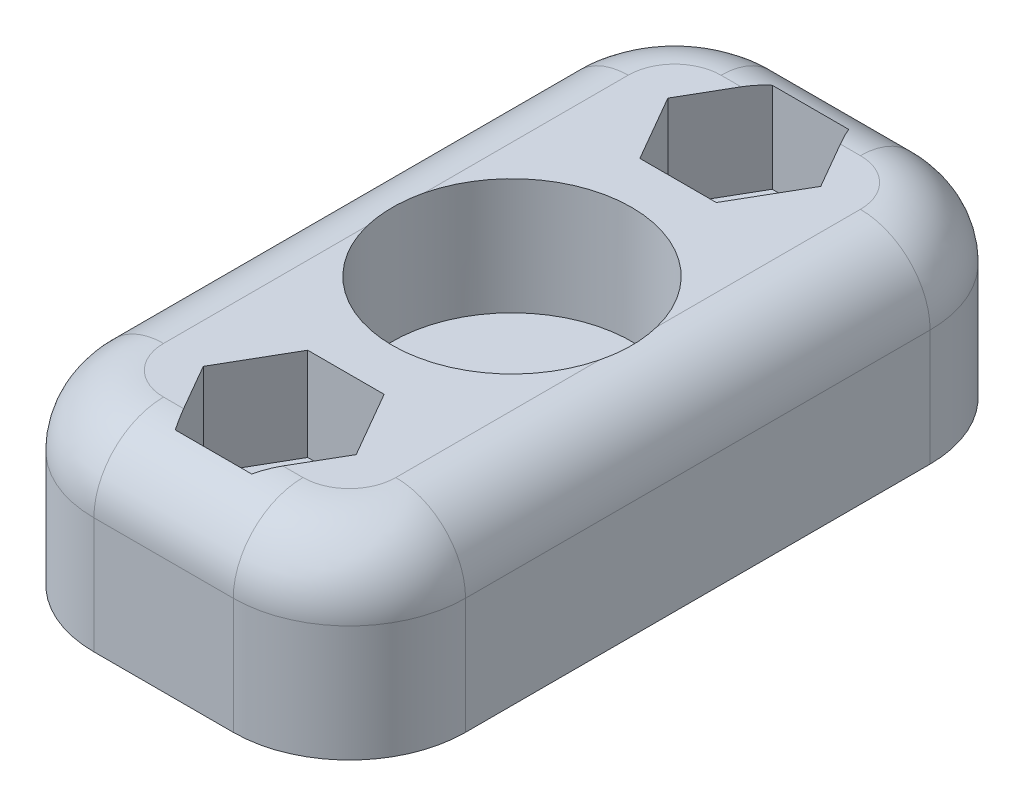
ISO-10303-21;
HEADER;
FILE_DESCRIPTION(('STEP AP214'),'2;1');
FILE_NAME('part.step','',(''),(''),'','','');
FILE_SCHEMA(('AUTOMOTIVE_DESIGN { 1 0 10303 214 1 1 1 1 }'));
ENDSEC;
DATA;
#1=APPLICATION_CONTEXT('core data for automotive mechanical design processes');
#2=APPLICATION_PROTOCOL_DEFINITION('international standard','automotive_design',2000,#1);
#3=PRODUCT_CONTEXT('',#1,'mechanical');
#4=PRODUCT('Part','Part','',(#3));
#5=PRODUCT_RELATED_PRODUCT_CATEGORY('part','',(#4));
#6=PRODUCT_DEFINITION_FORMATION('','',#4);
#7=PRODUCT_DEFINITION_CONTEXT('part definition',#1,'design');
#8=PRODUCT_DEFINITION('design','',#6,#7);
#9=PRODUCT_DEFINITION_SHAPE('','',#8);
#10=(LENGTH_UNIT() NAMED_UNIT(*) SI_UNIT(.MILLI.,.METRE.));
#11=(NAMED_UNIT(*) PLANE_ANGLE_UNIT() SI_UNIT($,.RADIAN.));
#12=(NAMED_UNIT(*) SI_UNIT($,.STERADIAN.) SOLID_ANGLE_UNIT());
#13=UNCERTAINTY_MEASURE_WITH_UNIT(LENGTH_MEASURE(1.E-05),#10,'distance_accuracy_value','');
#14=(GEOMETRIC_REPRESENTATION_CONTEXT(3) GLOBAL_UNCERTAINTY_ASSIGNED_CONTEXT((#13)) GLOBAL_UNIT_ASSIGNED_CONTEXT((#10,
#11,#12)) REPRESENTATION_CONTEXT('',''));
#15=CARTESIAN_POINT('',(0.,0.,0.));
#16=DIRECTION('',(0.,0.,1.));
#17=DIRECTION('',(1.,0.,0.));
#18=AXIS2_PLACEMENT_3D('',#15,#16,#17);
#19=CARTESIAN_POINT('',(0.,8.,0.));
#20=DIRECTION('',(0.,-1.,0.));
#21=DIRECTION('',(0.,0.,-1.));
#22=AXIS2_PLACEMENT_3D('',#19,#20,#21);
#23=PLANE('',#22);
#24=CARTESIAN_POINT('',(5.,8.,-25.));
#25=DIRECTION('',(0.,-1.,0.));
#26=DIRECTION('',(0.,0.,-1.));
#27=AXIS2_PLACEMENT_3D('',#24,#25,#26);
#28=CIRCLE('',#27,2.);
#29=CARTESIAN_POINT('',(5.,8.,-27.));
#30=VERTEX_POINT('',#29);
#31=CARTESIAN_POINT('',(3.,8.,-25.));
#32=VERTEX_POINT('',#31);
#33=EDGE_CURVE('E413',#30,#32,#28,.F.);
#34=ORIENTED_EDGE('',*,*,#33,.T.);
#35=DIRECTION('',(0.,0.,1.));
#36=VECTOR('',#35,1.);
#37=CARTESIAN_POINT('',(3.,8.,0.));
#38=LINE('',#37,#36);
#39=CARTESIAN_POINT('',(3.,8.,-16.2338962679253));
#40=VERTEX_POINT('',#39);
#41=EDGE_CURVE('E415',#32,#40,#38,.T.);
#42=ORIENTED_EDGE('',*,*,#41,.T.);
#43=CARTESIAN_POINT('',(8.,8.,-15.));
#44=DIRECTION('',(0.,1.,0.));
#45=DIRECTION('',(0.,0.,1.));
#46=AXIS2_PLACEMENT_3D('',#43,#44,#45);
#47=CIRCLE('',#46,5.15);
#48=CARTESIAN_POINT('',(13.,8.,-16.2338962679253));
#49=VERTEX_POINT('',#48);
#50=EDGE_CURVE('E338',#49,#40,#47,.T.);
#51=ORIENTED_EDGE('',*,*,#50,.F.);
#52=DIRECTION('',(0.,0.,-1.));
#53=VECTOR('',#52,1.);
#54=CARTESIAN_POINT('',(13.,8.,0.));
#55=LINE('',#54,#53);
#56=CARTESIAN_POINT('',(13.,8.,-25.));
#57=VERTEX_POINT('',#56);
#58=EDGE_CURVE('E405',#49,#57,#55,.T.);
#59=ORIENTED_EDGE('',*,*,#58,.T.);
#60=CARTESIAN_POINT('',(11.,8.,-25.));
#61=DIRECTION('',(0.,-1.,0.));
#62=DIRECTION('',(0.,0.,-1.));
#63=AXIS2_PLACEMENT_3D('',#60,#61,#62);
#64=CIRCLE('',#63,2.);
#65=CARTESIAN_POINT('',(11.,8.,-27.));
#66=VERTEX_POINT('',#65);
#67=EDGE_CURVE('E407',#57,#66,#64,.F.);
#68=ORIENTED_EDGE('',*,*,#67,.T.);
#69=DIRECTION('',(-1.,0.,0.));
#70=VECTOR('',#69,1.);
#71=CARTESIAN_POINT('',(0.,8.,-27.));
#72=LINE('',#71,#70);
#73=CARTESIAN_POINT('',(10.1361959960016,8.,-27.));
#74=VERTEX_POINT('',#73);
#75=EDGE_CURVE('E409',#66,#74,#72,.T.);
#76=ORIENTED_EDGE('',*,*,#75,.T.);
#77=DIRECTION('',(-0.499999999999998,0.,-0.86602540378444));
#78=VECTOR('',#77,1.);
#79=CARTESIAN_POINT('',(9.64544826719043,8.,-27.85));
#80=LINE('',#79,#78);
#81=CARTESIAN_POINT('',(11.2908965343809,8.,-25.));
#82=VERTEX_POINT('',#81);
#83=EDGE_CURVE('E258',#82,#74,#80,.T.);
#84=ORIENTED_EDGE('',*,*,#83,.F.);
#85=DIRECTION('',(0.499999999999998,0.,-0.866025403784439));
#86=VECTOR('',#85,1.);
#87=CARTESIAN_POINT('',(11.2908965343809,8.,-25.));
#88=LINE('',#87,#86);
#89=CARTESIAN_POINT('',(9.64544826719043,8.,-22.15));
#90=VERTEX_POINT('',#89);
#91=EDGE_CURVE('E261',#90,#82,#88,.T.);
#92=ORIENTED_EDGE('',*,*,#91,.F.);
#93=DIRECTION('',(1.,0.,0.));
#94=VECTOR('',#93,1.);
#95=CARTESIAN_POINT('',(9.64544826719043,8.,-22.15));
#96=LINE('',#95,#94);
#97=CARTESIAN_POINT('',(6.35455173280957,8.,-22.15));
#98=VERTEX_POINT('',#97);
#99=EDGE_CURVE('E275',#98,#90,#96,.T.);
#100=ORIENTED_EDGE('',*,*,#99,.F.);
#101=DIRECTION('',(0.499999999999998,0.,0.86602540378444));
#102=VECTOR('',#101,1.);
#103=CARTESIAN_POINT('',(6.35455173280957,8.,-22.15));
#104=LINE('',#103,#102);
#105=CARTESIAN_POINT('',(4.70910346561915,8.,-25.));
#106=VERTEX_POINT('',#105);
#107=EDGE_CURVE('E272',#106,#98,#104,.T.);
#108=ORIENTED_EDGE('',*,*,#107,.F.);
#109=DIRECTION('',(-0.499999999999998,0.,0.86602540378444));
#110=VECTOR('',#109,1.);
#111=CARTESIAN_POINT('',(4.70910346561915,8.,-25.));
#112=LINE('',#111,#110);
#113=CARTESIAN_POINT('',(5.86380400399839,8.,-27.));
#114=VERTEX_POINT('',#113);
#115=EDGE_CURVE('E240',#114,#106,#112,.T.);
#116=ORIENTED_EDGE('',*,*,#115,.F.);
#117=DIRECTION('',(-1.,0.,0.));
#118=VECTOR('',#117,1.);
#119=CARTESIAN_POINT('',(0.,8.,-27.));
#120=LINE('',#119,#118);
#121=EDGE_CURVE('E411',#114,#30,#120,.T.);
#122=ORIENTED_EDGE('',*,*,#121,.T.);
#123=EDGE_LOOP('',(#34,#42,#51,#59,#68,#76,#84,#92,#100,#108,#116,#122));
#124=FACE_BOUND('',#123,.T.);
#125=ADVANCED_FACE('F45',(#124),#23,.F.);
#126=CARTESIAN_POINT('',(3.,8.,-13.7661037320747));
#127=VERTEX_POINT('',#126);
#128=CARTESIAN_POINT('',(13.,8.,-13.7661037320747));
#129=VERTEX_POINT('',#128);
#130=EDGE_CURVE('E339',#127,#129,#47,.T.);
#131=ORIENTED_EDGE('',*,*,#130,.F.);
#132=DIRECTION('',(0.,0.,1.));
#133=VECTOR('',#132,1.);
#134=CARTESIAN_POINT('',(3.,8.,0.));
#135=LINE('',#134,#133);
#136=CARTESIAN_POINT('',(3.,8.,-5.));
#137=VERTEX_POINT('',#136);
#138=EDGE_CURVE('E403',#127,#137,#135,.T.);
#139=ORIENTED_EDGE('',*,*,#138,.T.);
#140=CARTESIAN_POINT('',(5.,8.,-5.));
#141=DIRECTION('',(0.,-1.,0.));
#142=DIRECTION('',(0.,0.,-1.));
#143=AXIS2_PLACEMENT_3D('',#140,#141,#142);
#144=CIRCLE('',#143,2.);
#145=CARTESIAN_POINT('',(5.,8.,-3.));
#146=VERTEX_POINT('',#145);
#147=EDGE_CURVE('E400',#137,#146,#144,.F.);
#148=ORIENTED_EDGE('',*,*,#147,.T.);
#149=DIRECTION('',(1.,0.,0.));
#150=VECTOR('',#149,1.);
#151=CARTESIAN_POINT('',(0.,8.,-3.));
#152=LINE('',#151,#150);
#153=CARTESIAN_POINT('',(5.86380400399839,8.,-3.));
#154=VERTEX_POINT('',#153);
#155=EDGE_CURVE('E398',#146,#154,#152,.T.);
#156=ORIENTED_EDGE('',*,*,#155,.T.);
#157=DIRECTION('',(0.499999999999998,0.,0.86602540378444));
#158=VECTOR('',#157,1.);
#159=CARTESIAN_POINT('',(6.35455173280957,8.,-2.15));
#160=LINE('',#159,#158);
#161=CARTESIAN_POINT('',(4.70910346561914,8.,-5.));
#162=VERTEX_POINT('',#161);
#163=EDGE_CURVE('E315',#162,#154,#160,.T.);
#164=ORIENTED_EDGE('',*,*,#163,.F.);
#165=DIRECTION('',(-0.499999999999998,0.,0.86602540378444));
#166=VECTOR('',#165,1.);
#167=CARTESIAN_POINT('',(4.70910346561915,8.,-5.));
#168=LINE('',#167,#166);
#169=CARTESIAN_POINT('',(6.35455173280957,8.,-7.85));
#170=VERTEX_POINT('',#169);
#171=EDGE_CURVE('E273',#170,#162,#168,.T.);
#172=ORIENTED_EDGE('',*,*,#171,.F.);
#173=DIRECTION('',(-1.,0.,0.));
#174=VECTOR('',#173,1.);
#175=CARTESIAN_POINT('',(6.35455173280957,8.,-7.85));
#176=LINE('',#175,#174);
#177=CARTESIAN_POINT('',(9.64544826719043,8.,-7.85));
#178=VERTEX_POINT('',#177);
#179=EDGE_CURVE('E306',#178,#170,#176,.T.);
#180=ORIENTED_EDGE('',*,*,#179,.F.);
#181=DIRECTION('',(-0.499999999999998,0.,-0.86602540378444));
#182=VECTOR('',#181,1.);
#183=CARTESIAN_POINT('',(9.64544826719043,8.,-7.85));
#184=LINE('',#183,#182);
#185=CARTESIAN_POINT('',(11.2908965343809,8.,-5.));
#186=VERTEX_POINT('',#185);
#187=EDGE_CURVE('E309',#186,#178,#184,.T.);
#188=ORIENTED_EDGE('',*,*,#187,.F.);
#189=DIRECTION('',(0.499999999999998,0.,-0.86602540378444));
#190=VECTOR('',#189,1.);
#191=CARTESIAN_POINT('',(11.2908965343809,8.,-5.));
#192=LINE('',#191,#190);
#193=CARTESIAN_POINT('',(10.1361959960016,8.,-3.));
#194=VERTEX_POINT('',#193);
#195=EDGE_CURVE('E313',#194,#186,#192,.T.);
#196=ORIENTED_EDGE('',*,*,#195,.F.);
#197=DIRECTION('',(1.,0.,0.));
#198=VECTOR('',#197,1.);
#199=CARTESIAN_POINT('',(0.,8.,-3.));
#200=LINE('',#199,#198);
#201=CARTESIAN_POINT('',(11.,8.,-3.));
#202=VERTEX_POINT('',#201);
#203=EDGE_CURVE('E388',#194,#202,#200,.T.);
#204=ORIENTED_EDGE('',*,*,#203,.T.);
#205=CARTESIAN_POINT('',(11.,8.,-5.));
#206=DIRECTION('',(0.,-1.,0.));
#207=DIRECTION('',(0.,0.,-1.));
#208=AXIS2_PLACEMENT_3D('',#205,#206,#207);
#209=CIRCLE('',#208,2.);
#210=CARTESIAN_POINT('',(13.,8.,-5.));
#211=VERTEX_POINT('',#210);
#212=EDGE_CURVE('E394',#202,#211,#209,.F.);
#213=ORIENTED_EDGE('',*,*,#212,.T.);
#214=DIRECTION('',(0.,0.,-1.));
#215=VECTOR('',#214,1.);
#216=CARTESIAN_POINT('',(13.,8.,0.));
#217=LINE('',#216,#215);
#218=EDGE_CURVE('E396',#211,#129,#217,.T.);
#219=ORIENTED_EDGE('',*,*,#218,.T.);
#220=EDGE_LOOP('',(#131,#139,#148,#156,#164,#172,#180,#188,#196,#204,#213,#219));
#221=FACE_BOUND('',#220,.T.);
#222=ADVANCED_FACE('F456',(#221),#23,.F.);
#223=CARTESIAN_POINT('',(0.,0.,0.));
#224=DIRECTION('',(0.,-1.,0.));
#225=DIRECTION('',(0.,0.,-1.));
#226=AXIS2_PLACEMENT_3D('',#223,#224,#225);
#227=PLANE('',#226);
#228=CARTESIAN_POINT('',(8.,0.,-25.));
#229=DIRECTION('',(0.,1.,0.));
#230=DIRECTION('',(0.,0.,1.));
#231=AXIS2_PLACEMENT_3D('',#228,#229,#230);
#232=CIRCLE('',#231,1.75);
#233=CARTESIAN_POINT('',(8.,0.,-23.25));
#234=VERTEX_POINT('',#233);
#235=EDGE_CURVE('E345',#234,#234,#232,.T.);
#236=ORIENTED_EDGE('',*,*,#235,.T.);
#237=EDGE_LOOP('',(#236));
#238=FACE_BOUND('',#237,.T.);
#239=DIRECTION('',(1.,0.,0.));
#240=VECTOR('',#239,1.);
#241=CARTESIAN_POINT('',(0.,0.,0.));
#242=LINE('',#241,#240);
#243=CARTESIAN_POINT('',(5.,0.,0.));
#244=VERTEX_POINT('',#243);
#245=CARTESIAN_POINT('',(11.,0.,0.));
#246=VERTEX_POINT('',#245);
#247=EDGE_CURVE('E351',#244,#246,#242,.T.);
#248=ORIENTED_EDGE('',*,*,#247,.F.);
#249=CARTESIAN_POINT('',(5.,0.,-5.));
#250=DIRECTION('',(0.,-1.,0.));
#251=DIRECTION('',(0.,0.,-1.));
#252=AXIS2_PLACEMENT_3D('',#249,#250,#251);
#253=CIRCLE('',#252,5.);
#254=CARTESIAN_POINT('',(0.,0.,-5.));
#255=VERTEX_POINT('',#254);
#256=EDGE_CURVE('E371',#244,#255,#253,.T.);
#257=ORIENTED_EDGE('',*,*,#256,.T.);
#258=DIRECTION('',(0.,0.,1.));
#259=VECTOR('',#258,1.);
#260=CARTESIAN_POINT('',(0.,0.,0.));
#261=LINE('',#260,#259);
#262=CARTESIAN_POINT('',(0.,0.,-25.));
#263=VERTEX_POINT('',#262);
#264=EDGE_CURVE('E348',#263,#255,#261,.T.);
#265=ORIENTED_EDGE('',*,*,#264,.F.);
#266=CARTESIAN_POINT('',(5.,0.,-25.));
#267=DIRECTION('',(0.,-1.,0.));
#268=DIRECTION('',(0.,0.,-1.));
#269=AXIS2_PLACEMENT_3D('',#266,#267,#268);
#270=CIRCLE('',#269,5.);
#271=CARTESIAN_POINT('',(5.,0.,-30.));
#272=VERTEX_POINT('',#271);
#273=EDGE_CURVE('E367',#263,#272,#270,.T.);
#274=ORIENTED_EDGE('',*,*,#273,.T.);
#275=DIRECTION('',(-1.,0.,0.));
#276=VECTOR('',#275,1.);
#277=CARTESIAN_POINT('',(0.,0.,-30.));
#278=LINE('',#277,#276);
#279=CARTESIAN_POINT('',(11.,0.,-30.));
#280=VERTEX_POINT('',#279);
#281=EDGE_CURVE('E357',#280,#272,#278,.T.);
#282=ORIENTED_EDGE('',*,*,#281,.F.);
#283=CARTESIAN_POINT('',(11.,0.,-25.));
#284=DIRECTION('',(0.,-1.,0.));
#285=DIRECTION('',(0.,0.,-1.));
#286=AXIS2_PLACEMENT_3D('',#283,#284,#285);
#287=CIRCLE('',#286,5.);
#288=CARTESIAN_POINT('',(16.,0.,-25.));
#289=VERTEX_POINT('',#288);
#290=EDGE_CURVE('E365',#280,#289,#287,.T.);
#291=ORIENTED_EDGE('',*,*,#290,.T.);
#292=DIRECTION('',(0.,0.,-1.));
#293=VECTOR('',#292,1.);
#294=CARTESIAN_POINT('',(16.,0.,0.));
#295=LINE('',#294,#293);
#296=CARTESIAN_POINT('',(16.,0.,-5.));
#297=VERTEX_POINT('',#296);
#298=EDGE_CURVE('E354',#297,#289,#295,.T.);
#299=ORIENTED_EDGE('',*,*,#298,.F.);
#300=CARTESIAN_POINT('',(11.,0.,-5.));
#301=DIRECTION('',(0.,-1.,0.));
#302=DIRECTION('',(0.,0.,-1.));
#303=AXIS2_PLACEMENT_3D('',#300,#301,#302);
#304=CIRCLE('',#303,5.);
#305=EDGE_CURVE('E369',#297,#246,#304,.T.);
#306=ORIENTED_EDGE('',*,*,#305,.T.);
#307=EDGE_LOOP('',(#248,#257,#265,#274,#282,#291,#299,#306));
#308=FACE_BOUND('',#307,.T.);
#309=CARTESIAN_POINT('',(8.,0.,-5.));
#310=DIRECTION('',(0.,1.,0.));
#311=DIRECTION('',(0.,0.,-1.));
#312=AXIS2_PLACEMENT_3D('',#309,#310,#311);
#313=CIRCLE('',#312,1.75);
#314=CARTESIAN_POINT('',(8.,0.,-6.75));
#315=VERTEX_POINT('',#314);
#316=EDGE_CURVE('E337',#315,#315,#313,.T.);
#317=ORIENTED_EDGE('',*,*,#316,.T.);
#318=EDGE_LOOP('',(#317));
#319=FACE_BOUND('',#318,.T.);
#320=ADVANCED_FACE('F459',(#238,#308,#319),#227,.T.);
#321=CARTESIAN_POINT('',(0.,8.,0.));
#322=DIRECTION('',(1.,0.,0.));
#323=DIRECTION('',(0.,0.,-1.));
#324=AXIS2_PLACEMENT_3D('',#321,#322,#323);
#325=PLANE('',#324);
#326=DIRECTION('',(0.,-1.,0.));
#327=VECTOR('',#326,1.);
#328=CARTESIAN_POINT('',(0.,8.,-5.));
#329=LINE('',#328,#327);
#330=CARTESIAN_POINT('',(0.,5.,-5.));
#331=VERTEX_POINT('',#330);
#332=EDGE_CURVE('E375',#255,#331,#329,.F.);
#333=ORIENTED_EDGE('',*,*,#332,.T.);
#334=DIRECTION('',(0.,0.,1.));
#335=VECTOR('',#334,1.);
#336=CARTESIAN_POINT('',(0.,5.,0.));
#337=LINE('',#336,#335);
#338=CARTESIAN_POINT('',(0.,5.,-25.));
#339=VERTEX_POINT('',#338);
#340=EDGE_CURVE('E545',#331,#339,#337,.F.);
#341=ORIENTED_EDGE('',*,*,#340,.T.);
#342=DIRECTION('',(0.,-1.,0.));
#343=VECTOR('',#342,1.);
#344=CARTESIAN_POINT('',(0.,8.,-25.));
#345=LINE('',#344,#343);
#346=EDGE_CURVE('E373',#339,#263,#345,.T.);
#347=ORIENTED_EDGE('',*,*,#346,.T.);
#348=ORIENTED_EDGE('',*,*,#264,.T.);
#349=EDGE_LOOP('',(#333,#341,#347,#348));
#350=FACE_BOUND('',#349,.T.);
#351=ADVANCED_FACE('F463',(#350),#325,.F.);
#352=CARTESIAN_POINT('',(0.,8.,0.));
#353=DIRECTION('',(0.,0.,-1.));
#354=DIRECTION('',(-1.,0.,0.));
#355=AXIS2_PLACEMENT_3D('',#352,#353,#354);
#356=PLANE('',#355);
#357=DIRECTION('',(0.,-1.,0.));
#358=VECTOR('',#357,1.);
#359=CARTESIAN_POINT('',(11.,8.,0.));
#360=LINE('',#359,#358);
#361=CARTESIAN_POINT('',(11.,5.,0.));
#362=VERTEX_POINT('',#361);
#363=EDGE_CURVE('E360',#246,#362,#360,.F.);
#364=ORIENTED_EDGE('',*,*,#363,.T.);
#365=DIRECTION('',(1.,0.,0.));
#366=VECTOR('',#365,1.);
#367=CARTESIAN_POINT('',(0.,5.,0.));
#368=LINE('',#367,#366);
#369=CARTESIAN_POINT('',(5.,5.,0.));
#370=VERTEX_POINT('',#369);
#371=EDGE_CURVE('E11',#362,#370,#368,.F.);
#372=ORIENTED_EDGE('',*,*,#371,.T.);
#373=DIRECTION('',(0.,-1.,0.));
#374=VECTOR('',#373,1.);
#375=CARTESIAN_POINT('',(5.,8.,0.));
#376=LINE('',#375,#374);
#377=EDGE_CURVE('E363',#370,#244,#376,.T.);
#378=ORIENTED_EDGE('',*,*,#377,.T.);
#379=ORIENTED_EDGE('',*,*,#247,.T.);
#380=EDGE_LOOP('',(#364,#372,#378,#379));
#381=FACE_BOUND('',#380,.T.);
#382=ADVANCED_FACE('F471',(#381),#356,.F.);
#383=CARTESIAN_POINT('',(16.,8.,0.));
#384=DIRECTION('',(-1.,0.,0.));
#385=DIRECTION('',(0.,0.,1.));
#386=AXIS2_PLACEMENT_3D('',#383,#384,#385);
#387=PLANE('',#386);
#388=DIRECTION('',(0.,-1.,0.));
#389=VECTOR('',#388,1.);
#390=CARTESIAN_POINT('',(16.,8.,-25.));
#391=LINE('',#390,#389);
#392=CARTESIAN_POINT('',(16.,5.,-25.));
#393=VERTEX_POINT('',#392);
#394=EDGE_CURVE('E378',#289,#393,#391,.F.);
#395=ORIENTED_EDGE('',*,*,#394,.T.);
#396=DIRECTION('',(0.,0.,-1.));
#397=VECTOR('',#396,1.);
#398=CARTESIAN_POINT('',(16.,5.,0.));
#399=LINE('',#398,#397);
#400=CARTESIAN_POINT('',(16.,5.,-5.));
#401=VERTEX_POINT('',#400);
#402=EDGE_CURVE('E559',#393,#401,#399,.F.);
#403=ORIENTED_EDGE('',*,*,#402,.T.);
#404=DIRECTION('',(0.,-1.,0.));
#405=VECTOR('',#404,1.);
#406=CARTESIAN_POINT('',(16.,8.,-5.));
#407=LINE('',#406,#405);
#408=EDGE_CURVE('E381',#401,#297,#407,.T.);
#409=ORIENTED_EDGE('',*,*,#408,.T.);
#410=ORIENTED_EDGE('',*,*,#298,.T.);
#411=EDGE_LOOP('',(#395,#403,#409,#410));
#412=FACE_BOUND('',#411,.T.);
#413=ADVANCED_FACE('F467',(#412),#387,.F.);
#414=CARTESIAN_POINT('',(0.,8.,-30.));
#415=DIRECTION('',(0.,0.,1.));
#416=DIRECTION('',(1.,0.,0.));
#417=AXIS2_PLACEMENT_3D('',#414,#415,#416);
#418=PLANE('',#417);
#419=DIRECTION('',(0.,-1.,0.));
#420=VECTOR('',#419,1.);
#421=CARTESIAN_POINT('',(5.,8.,-30.));
#422=LINE('',#421,#420);
#423=CARTESIAN_POINT('',(5.,5.,-30.));
#424=VERTEX_POINT('',#423);
#425=EDGE_CURVE('E385',#272,#424,#422,.F.);
#426=ORIENTED_EDGE('',*,*,#425,.T.);
#427=DIRECTION('',(-1.,0.,0.));
#428=VECTOR('',#427,1.);
#429=CARTESIAN_POINT('',(0.,5.,-30.));
#430=LINE('',#429,#428);
#431=CARTESIAN_POINT('',(11.,5.,-30.));
#432=VERTEX_POINT('',#431);
#433=EDGE_CURVE('E555',#424,#432,#430,.F.);
#434=ORIENTED_EDGE('',*,*,#433,.T.);
#435=DIRECTION('',(0.,-1.,0.));
#436=VECTOR('',#435,1.);
#437=CARTESIAN_POINT('',(11.,8.,-30.));
#438=LINE('',#437,#436);
#439=EDGE_CURVE('E383',#432,#280,#438,.T.);
#440=ORIENTED_EDGE('',*,*,#439,.T.);
#441=ORIENTED_EDGE('',*,*,#281,.T.);
#442=EDGE_LOOP('',(#426,#434,#440,#441));
#443=FACE_BOUND('',#442,.T.);
#444=ADVANCED_FACE('F454',(#443),#418,.F.);
#445=CARTESIAN_POINT('',(8.,8.,-25.));
#446=DIRECTION('',(0.,-1.,0.));
#447=DIRECTION('',(0.,0.,-1.));
#448=AXIS2_PLACEMENT_3D('',#445,#446,#447);
#449=CYLINDRICAL_SURFACE('',#448,1.75);
#450=CARTESIAN_POINT('',(8.,4.,-25.));
#451=DIRECTION('',(0.,-1.,0.));
#452=DIRECTION('',(0.,0.,-1.));
#453=AXIS2_PLACEMENT_3D('',#450,#451,#452);
#454=CIRCLE('',#453,1.75);
#455=CARTESIAN_POINT('',(8.,4.,-26.75));
#456=VERTEX_POINT('',#455);
#457=EDGE_CURVE('E342',#456,#456,#454,.T.);
#458=ORIENTED_EDGE('',*,*,#457,.F.);
#459=EDGE_LOOP('',(#458));
#460=FACE_BOUND('',#459,.T.);
#461=ORIENTED_EDGE('',*,*,#235,.F.);
#462=EDGE_LOOP('',(#461));
#463=FACE_BOUND('',#462,.T.);
#464=ADVANCED_FACE('F450',(#460,#463),#449,.F.);
#465=CARTESIAN_POINT('',(8.,8.,-5.));
#466=DIRECTION('',(0.,-1.,0.));
#467=DIRECTION('',(0.,0.,-1.));
#468=AXIS2_PLACEMENT_3D('',#465,#466,#467);
#469=CYLINDRICAL_SURFACE('',#468,1.75);
#470=CARTESIAN_POINT('',(8.,4.,-5.));
#471=DIRECTION('',(0.,-1.,0.));
#472=DIRECTION('',(0.,0.,-1.));
#473=AXIS2_PLACEMENT_3D('',#470,#471,#472);
#474=CIRCLE('',#473,1.75);
#475=CARTESIAN_POINT('',(8.,4.,-6.75));
#476=VERTEX_POINT('',#475);
#477=EDGE_CURVE('E282',#476,#476,#474,.T.);
#478=ORIENTED_EDGE('',*,*,#477,.F.);
#479=EDGE_LOOP('',(#478));
#480=FACE_BOUND('',#479,.T.);
#481=ORIENTED_EDGE('',*,*,#316,.F.);
#482=EDGE_LOOP('',(#481));
#483=FACE_BOUND('',#482,.T.);
#484=ADVANCED_FACE('F444',(#480,#483),#469,.F.);
#485=CARTESIAN_POINT('',(8.,3.,-15.));
#486=DIRECTION('',(0.,1.,0.));
#487=DIRECTION('',(0.,0.,1.));
#488=AXIS2_PLACEMENT_3D('',#485,#486,#487);
#489=CYLINDRICAL_SURFACE('',#488,5.15);
#490=CARTESIAN_POINT('',(8.,3.,-15.));
#491=DIRECTION('',(0.,1.,0.));
#492=DIRECTION('',(0.,0.,1.));
#493=AXIS2_PLACEMENT_3D('',#490,#491,#492);
#494=CIRCLE('',#493,5.15);
#495=CARTESIAN_POINT('',(8.,3.,-9.85));
#496=VERTEX_POINT('',#495);
#497=EDGE_CURVE('E334',#496,#496,#494,.T.);
#498=ORIENTED_EDGE('',*,*,#497,.F.);
#499=EDGE_LOOP('',(#498));
#500=FACE_BOUND('',#499,.T.);
#501=ORIENTED_EDGE('',*,*,#50,.T.);
#502=CARTESIAN_POINT('',(3.,8.,-16.2338962679253));
#503=CARTESIAN_POINT('',(2.9693348427124,7.99995433878383,-16.1096726365028));
#504=CARTESIAN_POINT('',(2.94331745158033,7.99952800872603,-15.9843054356251));
#505=CARTESIAN_POINT('',(2.90067770771265,7.99844352484611,-15.7319595983456));
#506=CARTESIAN_POINT('',(2.88405713441141,7.99778532715451,-15.604980661388));
#507=CARTESIAN_POINT('',(2.86053019663547,7.99677596296455,-15.3523676885187));
#508=CARTESIAN_POINT('',(2.85345869644921,7.99641961793105,-15.2267490812954));
#509=CARTESIAN_POINT('',(2.84852469710433,7.99617465392725,-14.9753745735996));
#510=CARTESIAN_POINT('',(2.85065982147749,7.99628591425571,-14.8496187169329));
#511=CARTESIAN_POINT('',(2.86600988443529,7.99702161326098,-14.5635794261092));
#512=CARTESIAN_POINT('',(2.88214631032478,7.99778040473618,-14.4034388700295));
#513=CARTESIAN_POINT('',(2.91764846536141,7.9988915020192,-14.1640448025117));
#514=CARTESIAN_POINT('',(2.93147730408653,7.99925937223891,-14.0839282642454));
#515=CARTESIAN_POINT('',(2.96291287169983,7.99981110271986,-13.9244266670112));
#516=CARTESIAN_POINT('',(2.98052017049936,7.99999493519867,-13.8450417202764));
#517=CARTESIAN_POINT('',(3.,8.,-13.7661037320747));
#518=B_SPLINE_CURVE_WITH_KNOTS('',3,(#502,#503,#504,#505,#506,#507,#508,#509,#510,#511,#512,
#513,#514,#515,#516,#517),.UNSPECIFIED.,.F.,.F.,(4,2,2,2,2,2,2,4),(0.,0.383763617130559,
0.76759988158234,1.14470946569461,1.52172171388608,2.00378387199943,2.24761315566571,
2.49147924238542),.UNSPECIFIED.);
#519=EDGE_CURVE('E428',#40,#127,#518,.T.);
#520=ORIENTED_EDGE('',*,*,#519,.T.);
#521=ORIENTED_EDGE('',*,*,#130,.T.);
#522=CARTESIAN_POINT('',(13.,8.,-13.7661037320747));
#523=CARTESIAN_POINT('',(13.0306651572876,7.99995433878383,-13.8903273634972));
#524=CARTESIAN_POINT('',(13.0566825484197,7.99952800872603,-14.0156945643749));
#525=CARTESIAN_POINT('',(13.0993222922874,7.99844352484611,-14.2680404016545));
#526=CARTESIAN_POINT('',(13.1159428655886,7.99778532715451,-14.395019338612));
#527=CARTESIAN_POINT('',(13.1394698033645,7.99677596296455,-14.6476323114813));
#528=CARTESIAN_POINT('',(13.1465413035508,7.99641961793105,-14.7732509187047));
#529=CARTESIAN_POINT('',(13.1514753028957,7.99617465392725,-15.0246254264004));
#530=CARTESIAN_POINT('',(13.1493401785225,7.99628591425571,-15.1503812830671));
#531=CARTESIAN_POINT('',(13.1339901155647,7.99702161326098,-15.4364205738908));
#532=CARTESIAN_POINT('',(13.1178536896752,7.99778040473618,-15.5965611299705));
#533=CARTESIAN_POINT('',(13.0823515346386,7.9988915020192,-15.8359551974883));
#534=CARTESIAN_POINT('',(13.0685226959135,7.99925937223891,-15.9160717357546));
#535=CARTESIAN_POINT('',(13.0370871283002,7.99981110271986,-16.0755733329888));
#536=CARTESIAN_POINT('',(13.0194798295006,7.99999493519867,-16.1549582797236));
#537=CARTESIAN_POINT('',(13.,8.,-16.2338962679253));
#538=B_SPLINE_CURVE_WITH_KNOTS('',3,(#522,#523,#524,#525,#526,#527,#528,#529,#530,#531,#532,
#533,#534,#535,#536,#537),.UNSPECIFIED.,.F.,.F.,(4,2,2,2,2,2,2,4),(0.,0.383763617130561,
0.76759988158234,1.14470946569461,1.52172171388608,2.00378387199941,2.24761315566568,
2.49147924238538),.UNSPECIFIED.);
#539=EDGE_CURVE('E420',#129,#49,#538,.T.);
#540=ORIENTED_EDGE('',*,*,#539,.T.);
#541=EDGE_LOOP('',(#501,#520,#521,#540));
#542=FACE_BOUND('',#541,.T.);
#543=ADVANCED_FACE('F438',(#500,#542),#489,.F.);
#544=CARTESIAN_POINT('',(8.,3.,-15.));
#545=DIRECTION('',(0.,1.,0.));
#546=DIRECTION('',(0.,0.,1.));
#547=AXIS2_PLACEMENT_3D('',#544,#545,#546);
#548=PLANE('',#547);
#549=ORIENTED_EDGE('',*,*,#497,.T.);
#550=EDGE_LOOP('',(#549));
#551=FACE_BOUND('',#550,.T.);
#552=ADVANCED_FACE('F443',(#551),#548,.T.);
#553=CARTESIAN_POINT('',(5.,8.,-5.));
#554=DIRECTION('',(0.,-1.,0.));
#555=DIRECTION('',(0.,0.,-1.));
#556=AXIS2_PLACEMENT_3D('',#553,#554,#555);
#557=CYLINDRICAL_SURFACE('',#556,5.);
#558=ORIENTED_EDGE('',*,*,#377,.F.);
#559=CARTESIAN_POINT('',(5.,5.,-5.));
#560=DIRECTION('',(0.,-1.,0.));
#561=DIRECTION('',(0.,0.,-1.));
#562=AXIS2_PLACEMENT_3D('',#559,#560,#561);
#563=CIRCLE('',#562,5.);
#564=EDGE_CURVE('E417',#370,#331,#563,.T.);
#565=ORIENTED_EDGE('',*,*,#564,.T.);
#566=ORIENTED_EDGE('',*,*,#332,.F.);
#567=ORIENTED_EDGE('',*,*,#256,.F.);
#568=EDGE_LOOP('',(#558,#565,#566,#567));
#569=FACE_BOUND('',#568,.T.);
#570=ADVANCED_FACE('F479',(#569),#557,.T.);
#571=CARTESIAN_POINT('',(11.,8.,-5.));
#572=DIRECTION('',(0.,-1.,0.));
#573=DIRECTION('',(0.,0.,-1.));
#574=AXIS2_PLACEMENT_3D('',#571,#572,#573);
#575=CYLINDRICAL_SURFACE('',#574,5.);
#576=ORIENTED_EDGE('',*,*,#408,.F.);
#577=CARTESIAN_POINT('',(11.,5.,-5.));
#578=DIRECTION('',(0.,-1.,0.));
#579=DIRECTION('',(0.,0.,-1.));
#580=AXIS2_PLACEMENT_3D('',#577,#578,#579);
#581=CIRCLE('',#580,5.);
#582=EDGE_CURVE('E561',#401,#362,#581,.T.);
#583=ORIENTED_EDGE('',*,*,#582,.T.);
#584=ORIENTED_EDGE('',*,*,#363,.F.);
#585=ORIENTED_EDGE('',*,*,#305,.F.);
#586=EDGE_LOOP('',(#576,#583,#584,#585));
#587=FACE_BOUND('',#586,.T.);
#588=ADVANCED_FACE('F482',(#587),#575,.T.);
#589=CARTESIAN_POINT('',(5.,8.,-25.));
#590=DIRECTION('',(0.,-1.,0.));
#591=DIRECTION('',(0.,0.,-1.));
#592=AXIS2_PLACEMENT_3D('',#589,#590,#591);
#593=CYLINDRICAL_SURFACE('',#592,5.);
#594=ORIENTED_EDGE('',*,*,#346,.F.);
#595=CARTESIAN_POINT('',(5.,5.,-25.));
#596=DIRECTION('',(0.,-1.,0.));
#597=DIRECTION('',(0.,0.,-1.));
#598=AXIS2_PLACEMENT_3D('',#595,#596,#597);
#599=CIRCLE('',#598,5.);
#600=EDGE_CURVE('E535',#339,#424,#599,.T.);
#601=ORIENTED_EDGE('',*,*,#600,.T.);
#602=ORIENTED_EDGE('',*,*,#425,.F.);
#603=ORIENTED_EDGE('',*,*,#273,.F.);
#604=EDGE_LOOP('',(#594,#601,#602,#603));
#605=FACE_BOUND('',#604,.T.);
#606=ADVANCED_FACE('F486',(#605),#593,.T.);
#607=CARTESIAN_POINT('',(11.,8.,-25.));
#608=DIRECTION('',(0.,-1.,0.));
#609=DIRECTION('',(0.,0.,-1.));
#610=AXIS2_PLACEMENT_3D('',#607,#608,#609);
#611=CYLINDRICAL_SURFACE('',#610,5.);
#612=ORIENTED_EDGE('',*,*,#439,.F.);
#613=CARTESIAN_POINT('',(11.,5.,-25.));
#614=DIRECTION('',(0.,-1.,0.));
#615=DIRECTION('',(0.,0.,-1.));
#616=AXIS2_PLACEMENT_3D('',#613,#614,#615);
#617=CIRCLE('',#616,5.);
#618=EDGE_CURVE('E557',#432,#393,#617,.T.);
#619=ORIENTED_EDGE('',*,*,#618,.T.);
#620=ORIENTED_EDGE('',*,*,#394,.F.);
#621=ORIENTED_EDGE('',*,*,#290,.F.);
#622=EDGE_LOOP('',(#612,#619,#620,#621));
#623=FACE_BOUND('',#622,.T.);
#624=ADVANCED_FACE('F490',(#623),#611,.T.);
#625=CARTESIAN_POINT('',(4.70910346561915,4.,-5.));
#626=DIRECTION('',(-0.86602540378444,0.,-0.499999999999998));
#627=DIRECTION('',(-0.499999999999998,0.,0.86602540378444));
#628=AXIS2_PLACEMENT_3D('',#625,#626,#627);
#629=PLANE('',#628);
#630=ORIENTED_EDGE('',*,*,#171,.T.);
#631=DIRECTION('',(0.,1.,0.));
#632=VECTOR('',#631,1.);
#633=CARTESIAN_POINT('',(4.70910346561915,4.,-5.));
#634=LINE('',#633,#632);
#635=CARTESIAN_POINT('',(4.70910346561915,4.,-5.));
#636=VERTEX_POINT('',#635);
#637=EDGE_CURVE('E291',#636,#162,#634,.T.);
#638=ORIENTED_EDGE('',*,*,#637,.F.);
#639=DIRECTION('',(-0.499999999999998,0.,0.86602540378444));
#640=VECTOR('',#639,1.);
#641=CARTESIAN_POINT('',(4.70910346561915,4.,-5.));
#642=LINE('',#641,#640);
#643=CARTESIAN_POINT('',(6.35455173280957,4.,-7.85));
#644=VERTEX_POINT('',#643);
#645=EDGE_CURVE('E310',#644,#636,#642,.T.);
#646=ORIENTED_EDGE('',*,*,#645,.F.);
#647=DIRECTION('',(0.,1.,0.));
#648=VECTOR('',#647,1.);
#649=CARTESIAN_POINT('',(6.35455173280957,4.,-7.85));
#650=LINE('',#649,#648);
#651=EDGE_CURVE('E304',#644,#170,#650,.T.);
#652=ORIENTED_EDGE('',*,*,#651,.T.);
#653=EDGE_LOOP('',(#630,#638,#646,#652));
#654=FACE_BOUND('',#653,.T.);
#655=ADVANCED_FACE('F494',(#654),#629,.F.);
#656=CARTESIAN_POINT('',(6.35455173280957,4.,-7.85));
#657=DIRECTION('',(0.,0.,-1.));
#658=DIRECTION('',(-1.,0.,0.));
#659=AXIS2_PLACEMENT_3D('',#656,#657,#658);
#660=PLANE('',#659);
#661=ORIENTED_EDGE('',*,*,#179,.T.);
#662=ORIENTED_EDGE('',*,*,#651,.F.);
#663=DIRECTION('',(-1.,0.,0.));
#664=VECTOR('',#663,1.);
#665=CARTESIAN_POINT('',(6.35455173280957,4.,-7.85));
#666=LINE('',#665,#664);
#667=CARTESIAN_POINT('',(9.64544826719043,4.,-7.85));
#668=VERTEX_POINT('',#667);
#669=EDGE_CURVE('E294',#668,#644,#666,.T.);
#670=ORIENTED_EDGE('',*,*,#669,.F.);
#671=DIRECTION('',(0.,1.,0.));
#672=VECTOR('',#671,1.);
#673=CARTESIAN_POINT('',(9.64544826719043,4.,-7.85));
#674=LINE('',#673,#672);
#675=EDGE_CURVE('E302',#668,#178,#674,.T.);
#676=ORIENTED_EDGE('',*,*,#675,.T.);
#677=EDGE_LOOP('',(#661,#662,#670,#676));
#678=FACE_BOUND('',#677,.T.);
#679=ADVANCED_FACE('F647',(#678),#660,.F.);
#680=CARTESIAN_POINT('',(9.64544826719043,4.,-7.85));
#681=DIRECTION('',(0.86602540378444,0.,-0.499999999999998));
#682=DIRECTION('',(-0.499999999999998,0.,-0.86602540378444));
#683=AXIS2_PLACEMENT_3D('',#680,#681,#682);
#684=PLANE('',#683);
#685=ORIENTED_EDGE('',*,*,#187,.T.);
#686=ORIENTED_EDGE('',*,*,#675,.F.);
#687=DIRECTION('',(-0.499999999999998,0.,-0.86602540378444));
#688=VECTOR('',#687,1.);
#689=CARTESIAN_POINT('',(9.64544826719043,4.,-7.85));
#690=LINE('',#689,#688);
#691=CARTESIAN_POINT('',(11.2908965343809,4.,-5.));
#692=VERTEX_POINT('',#691);
#693=EDGE_CURVE('E320',#692,#668,#690,.T.);
#694=ORIENTED_EDGE('',*,*,#693,.F.);
#695=DIRECTION('',(0.,1.,0.));
#696=VECTOR('',#695,1.);
#697=CARTESIAN_POINT('',(11.2908965343809,4.,-5.));
#698=LINE('',#697,#696);
#699=EDGE_CURVE('E299',#692,#186,#698,.T.);
#700=ORIENTED_EDGE('',*,*,#699,.T.);
#701=EDGE_LOOP('',(#685,#686,#694,#700));
#702=FACE_BOUND('',#701,.T.);
#703=ADVANCED_FACE('F658',(#702),#684,.F.);
#704=CARTESIAN_POINT('',(11.2908965343809,4.,-5.));
#705=DIRECTION('',(0.86602540378444,0.,0.499999999999998));
#706=DIRECTION('',(0.499999999999998,0.,-0.86602540378444));
#707=AXIS2_PLACEMENT_3D('',#704,#705,#706);
#708=PLANE('',#707);
#709=DIRECTION('',(0.,1.,0.));
#710=VECTOR('',#709,1.);
#711=CARTESIAN_POINT('',(9.64544826719043,4.,-2.15));
#712=LINE('',#711,#710);
#713=CARTESIAN_POINT('',(9.64544826719043,4.,-2.15));
#714=VERTEX_POINT('',#713);
#715=CARTESIAN_POINT('',(9.64544826719043,7.87706447616316,-2.15));
#716=VERTEX_POINT('',#715);
#717=EDGE_CURVE('E297',#714,#716,#712,.T.);
#718=ORIENTED_EDGE('',*,*,#717,.T.);
#719=CARTESIAN_POINT('',(10.1361959960016,5.,-3.));
#720=DIRECTION('',(0.86602540378444,0.,0.499999999999998));
#721=DIRECTION('',(0.499999999999998,0.,-0.86602540378444));
#722=AXIS2_PLACEMENT_3D('',#719,#720,#721);
#723=ELLIPSE('',#722,3.46410161513775,3.);
#724=EDGE_CURVE('E54',#716,#194,#723,.F.);
#725=ORIENTED_EDGE('',*,*,#724,.T.);
#726=ORIENTED_EDGE('',*,*,#195,.T.);
#727=ORIENTED_EDGE('',*,*,#699,.F.);
#728=DIRECTION('',(0.499999999999998,0.,-0.86602540378444));
#729=VECTOR('',#728,1.);
#730=CARTESIAN_POINT('',(11.2908965343809,4.,-5.));
#731=LINE('',#730,#729);
#732=EDGE_CURVE('E323',#714,#692,#731,.T.);
#733=ORIENTED_EDGE('',*,*,#732,.F.);
#734=EDGE_LOOP('',(#718,#725,#726,#727,#733));
#735=FACE_BOUND('',#734,.T.);
#736=ADVANCED_FACE('F655',(#735),#708,.F.);
#737=CARTESIAN_POINT('',(9.64544826719043,4.,-2.15));
#738=DIRECTION('',(0.,0.,1.));
#739=DIRECTION('',(1.,0.,0.));
#740=AXIS2_PLACEMENT_3D('',#737,#738,#739);
#741=PLANE('',#740);
#742=DIRECTION('',(0.,1.,0.));
#743=VECTOR('',#742,1.);
#744=CARTESIAN_POINT('',(6.35455173280957,4.,-2.15));
#745=LINE('',#744,#743);
#746=CARTESIAN_POINT('',(6.35455173280957,4.,-2.15));
#747=VERTEX_POINT('',#746);
#748=CARTESIAN_POINT('',(6.35455173280957,7.87706447616316,-2.15));
#749=VERTEX_POINT('',#748);
#750=EDGE_CURVE('E295',#747,#749,#745,.T.);
#751=ORIENTED_EDGE('',*,*,#750,.T.);
#752=DIRECTION('',(1.,0.,0.));
#753=VECTOR('',#752,1.);
#754=CARTESIAN_POINT('',(6.35455173280957,7.87706447616316,-2.15));
#755=LINE('',#754,#753);
#756=EDGE_CURVE('E62',#749,#716,#755,.T.);
#757=ORIENTED_EDGE('',*,*,#756,.T.);
#758=ORIENTED_EDGE('',*,*,#717,.F.);
#759=DIRECTION('',(1.,0.,0.));
#760=VECTOR('',#759,1.);
#761=CARTESIAN_POINT('',(9.64544826719043,4.,-2.15));
#762=LINE('',#761,#760);
#763=EDGE_CURVE('E326',#747,#714,#762,.T.);
#764=ORIENTED_EDGE('',*,*,#763,.F.);
#765=EDGE_LOOP('',(#751,#757,#758,#764));
#766=FACE_BOUND('',#765,.T.);
#767=ADVANCED_FACE('F652',(#766),#741,.F.);
#768=CARTESIAN_POINT('',(6.35455173280957,4.,-2.15));
#769=DIRECTION('',(-0.86602540378444,0.,0.499999999999998));
#770=DIRECTION('',(0.499999999999998,0.,0.86602540378444));
#771=AXIS2_PLACEMENT_3D('',#768,#769,#770);
#772=PLANE('',#771);
#773=ORIENTED_EDGE('',*,*,#163,.T.);
#774=CARTESIAN_POINT('',(5.86380400399839,5.,-3.));
#775=DIRECTION('',(-0.86602540378444,0.,0.499999999999998));
#776=DIRECTION('',(0.499999999999998,0.,0.86602540378444));
#777=AXIS2_PLACEMENT_3D('',#774,#775,#776);
#778=ELLIPSE('',#777,3.46410161513775,3.);
#779=EDGE_CURVE('E70',#154,#749,#778,.F.);
#780=ORIENTED_EDGE('',*,*,#779,.T.);
#781=ORIENTED_EDGE('',*,*,#750,.F.);
#782=DIRECTION('',(0.499999999999998,0.,0.86602540378444));
#783=VECTOR('',#782,1.);
#784=CARTESIAN_POINT('',(6.35455173280957,4.,-2.15));
#785=LINE('',#784,#783);
#786=EDGE_CURVE('E329',#636,#747,#785,.T.);
#787=ORIENTED_EDGE('',*,*,#786,.F.);
#788=ORIENTED_EDGE('',*,*,#637,.T.);
#789=EDGE_LOOP('',(#773,#780,#781,#787,#788));
#790=FACE_BOUND('',#789,.T.);
#791=ADVANCED_FACE('F649',(#790),#772,.F.);
#792=CARTESIAN_POINT('',(0.,4.,0.));
#793=DIRECTION('',(0.,-1.,0.));
#794=DIRECTION('',(0.,0.,-1.));
#795=AXIS2_PLACEMENT_3D('',#792,#793,#794);
#796=PLANE('',#795);
#797=ORIENTED_EDGE('',*,*,#477,.T.);
#798=EDGE_LOOP('',(#797));
#799=FACE_BOUND('',#798,.T.);
#800=ORIENTED_EDGE('',*,*,#645,.T.);
#801=ORIENTED_EDGE('',*,*,#786,.T.);
#802=ORIENTED_EDGE('',*,*,#763,.T.);
#803=ORIENTED_EDGE('',*,*,#732,.T.);
#804=ORIENTED_EDGE('',*,*,#693,.T.);
#805=ORIENTED_EDGE('',*,*,#669,.T.);
#806=EDGE_LOOP('',(#800,#801,#802,#803,#804,#805));
#807=FACE_BOUND('',#806,.T.);
#808=ADVANCED_FACE('F644',(#799,#807),#796,.F.);
#809=CARTESIAN_POINT('',(4.70910346561915,4.,-25.));
#810=DIRECTION('',(-0.86602540378444,0.,-0.499999999999998));
#811=DIRECTION('',(-0.499999999999998,0.,0.86602540378444));
#812=AXIS2_PLACEMENT_3D('',#809,#810,#811);
#813=PLANE('',#812);
#814=DIRECTION('',(0.,1.,0.));
#815=VECTOR('',#814,1.);
#816=CARTESIAN_POINT('',(6.35455173280957,4.,-27.85));
#817=LINE('',#816,#815);
#818=CARTESIAN_POINT('',(6.35455173280957,4.,-27.85));
#819=VERTEX_POINT('',#818);
#820=CARTESIAN_POINT('',(6.35455173280957,7.87706447616316,-27.85));
#821=VERTEX_POINT('',#820);
#822=EDGE_CURVE('E280',#819,#821,#817,.T.);
#823=ORIENTED_EDGE('',*,*,#822,.T.);
#824=CARTESIAN_POINT('',(5.86380400399839,5.,-27.));
#825=DIRECTION('',(-0.86602540378444,0.,-0.499999999999998));
#826=DIRECTION('',(-0.499999999999998,0.,0.86602540378444));
#827=AXIS2_PLACEMENT_3D('',#824,#825,#826);
#828=ELLIPSE('',#827,3.46410161513775,3.);
#829=EDGE_CURVE('E553',#821,#114,#828,.F.);
#830=ORIENTED_EDGE('',*,*,#829,.T.);
#831=ORIENTED_EDGE('',*,*,#115,.T.);
#832=DIRECTION('',(0.,1.,0.));
#833=VECTOR('',#832,1.);
#834=CARTESIAN_POINT('',(4.70910346561915,4.,-25.));
#835=LINE('',#834,#833);
#836=CARTESIAN_POINT('',(4.70910346561915,4.,-25.));
#837=VERTEX_POINT('',#836);
#838=EDGE_CURVE('E232',#837,#106,#835,.T.);
#839=ORIENTED_EDGE('',*,*,#838,.F.);
#840=DIRECTION('',(-0.499999999999998,0.,0.86602540378444));
#841=VECTOR('',#840,1.);
#842=CARTESIAN_POINT('',(4.70910346561915,4.,-25.));
#843=LINE('',#842,#841);
#844=EDGE_CURVE('E237',#819,#837,#843,.T.);
#845=ORIENTED_EDGE('',*,*,#844,.F.);
#846=EDGE_LOOP('',(#823,#830,#831,#839,#845));
#847=FACE_BOUND('',#846,.T.);
#848=ADVANCED_FACE('F235',(#847),#813,.F.);
#849=CARTESIAN_POINT('',(6.35455173280957,4.,-27.85));
#850=DIRECTION('',(0.,0.,-1.));
#851=DIRECTION('',(-1.,0.,0.));
#852=AXIS2_PLACEMENT_3D('',#849,#850,#851);
#853=PLANE('',#852);
#854=DIRECTION('',(0.,1.,0.));
#855=VECTOR('',#854,1.);
#856=CARTESIAN_POINT('',(9.64544826719043,4.,-27.85));
#857=LINE('',#856,#855);
#858=CARTESIAN_POINT('',(9.64544826719043,4.,-27.85));
#859=VERTEX_POINT('',#858);
#860=CARTESIAN_POINT('',(9.64544826719043,7.87706447616316,-27.85));
#861=VERTEX_POINT('',#860);
#862=EDGE_CURVE('E283',#859,#861,#857,.T.);
#863=ORIENTED_EDGE('',*,*,#862,.T.);
#864=DIRECTION('',(-1.,0.,0.));
#865=VECTOR('',#864,1.);
#866=CARTESIAN_POINT('',(9.64544826719043,7.87706447616316,-27.85));
#867=LINE('',#866,#865);
#868=EDGE_CURVE('E551',#861,#821,#867,.T.);
#869=ORIENTED_EDGE('',*,*,#868,.T.);
#870=ORIENTED_EDGE('',*,*,#822,.F.);
#871=DIRECTION('',(-1.,0.,0.));
#872=VECTOR('',#871,1.);
#873=CARTESIAN_POINT('',(6.35455173280957,4.,-27.85));
#874=LINE('',#873,#872);
#875=EDGE_CURVE('E245',#859,#819,#874,.T.);
#876=ORIENTED_EDGE('',*,*,#875,.F.);
#877=EDGE_LOOP('',(#863,#869,#870,#876));
#878=FACE_BOUND('',#877,.T.);
#879=ADVANCED_FACE('F622',(#878),#853,.F.);
#880=CARTESIAN_POINT('',(9.64544826719043,4.,-27.85));
#881=DIRECTION('',(0.86602540378444,0.,-0.499999999999998));
#882=DIRECTION('',(-0.499999999999998,0.,-0.86602540378444));
#883=AXIS2_PLACEMENT_3D('',#880,#881,#882);
#884=PLANE('',#883);
#885=ORIENTED_EDGE('',*,*,#83,.T.);
#886=CARTESIAN_POINT('',(10.1361959960016,5.,-27.));
#887=DIRECTION('',(0.86602540378444,0.,-0.499999999999998));
#888=DIRECTION('',(-0.499999999999998,0.,-0.86602540378444));
#889=AXIS2_PLACEMENT_3D('',#886,#887,#888);
#890=ELLIPSE('',#889,3.46410161513775,3.);
#891=EDGE_CURVE('E547',#74,#861,#890,.F.);
#892=ORIENTED_EDGE('',*,*,#891,.T.);
#893=ORIENTED_EDGE('',*,*,#862,.F.);
#894=DIRECTION('',(-0.499999999999998,0.,-0.86602540378444));
#895=VECTOR('',#894,1.);
#896=CARTESIAN_POINT('',(9.64544826719043,4.,-27.85));
#897=LINE('',#896,#895);
#898=CARTESIAN_POINT('',(11.2908965343809,4.,-25.));
#899=VERTEX_POINT('',#898);
#900=EDGE_CURVE('E268',#899,#859,#897,.T.);
#901=ORIENTED_EDGE('',*,*,#900,.F.);
#902=DIRECTION('',(0.,1.,0.));
#903=VECTOR('',#902,1.);
#904=CARTESIAN_POINT('',(11.2908965343809,4.,-25.));
#905=LINE('',#904,#903);
#906=EDGE_CURVE('E286',#899,#82,#905,.T.);
#907=ORIENTED_EDGE('',*,*,#906,.T.);
#908=EDGE_LOOP('',(#885,#892,#893,#901,#907));
#909=FACE_BOUND('',#908,.T.);
#910=ADVANCED_FACE('F617',(#909),#884,.F.);
#911=CARTESIAN_POINT('',(11.2908965343809,4.,-25.));
#912=DIRECTION('',(0.86602540378444,0.,0.499999999999999));
#913=DIRECTION('',(0.499999999999998,0.,-0.866025403784439));
#914=AXIS2_PLACEMENT_3D('',#911,#912,#913);
#915=PLANE('',#914);
#916=ORIENTED_EDGE('',*,*,#91,.T.);
#917=ORIENTED_EDGE('',*,*,#906,.F.);
#918=DIRECTION('',(0.499999999999998,0.,-0.866025403784439));
#919=VECTOR('',#918,1.);
#920=CARTESIAN_POINT('',(11.2908965343809,4.,-25.));
#921=LINE('',#920,#919);
#922=CARTESIAN_POINT('',(9.64544826719043,4.,-22.15));
#923=VERTEX_POINT('',#922);
#924=EDGE_CURVE('E265',#923,#899,#921,.T.);
#925=ORIENTED_EDGE('',*,*,#924,.F.);
#926=DIRECTION('',(0.,1.,0.));
#927=VECTOR('',#926,1.);
#928=CARTESIAN_POINT('',(9.64544826719043,4.,-22.15));
#929=LINE('',#928,#927);
#930=EDGE_CURVE('E288',#923,#90,#929,.T.);
#931=ORIENTED_EDGE('',*,*,#930,.T.);
#932=EDGE_LOOP('',(#916,#917,#925,#931));
#933=FACE_BOUND('',#932,.T.);
#934=ADVANCED_FACE('F628',(#933),#915,.F.);
#935=CARTESIAN_POINT('',(9.64544826719043,4.,-22.15));
#936=DIRECTION('',(0.,0.,1.));
#937=DIRECTION('',(1.,0.,0.));
#938=AXIS2_PLACEMENT_3D('',#935,#936,#937);
#939=PLANE('',#938);
#940=ORIENTED_EDGE('',*,*,#99,.T.);
#941=ORIENTED_EDGE('',*,*,#930,.F.);
#942=DIRECTION('',(1.,0.,0.));
#943=VECTOR('',#942,1.);
#944=CARTESIAN_POINT('',(9.64544826719043,4.,-22.15));
#945=LINE('',#944,#943);
#946=CARTESIAN_POINT('',(6.35455173280957,4.,-22.15));
#947=VERTEX_POINT('',#946);
#948=EDGE_CURVE('E253',#947,#923,#945,.T.);
#949=ORIENTED_EDGE('',*,*,#948,.F.);
#950=DIRECTION('',(0.,1.,0.));
#951=VECTOR('',#950,1.);
#952=CARTESIAN_POINT('',(6.35455173280957,4.,-22.15));
#953=LINE('',#952,#951);
#954=EDGE_CURVE('E244',#947,#98,#953,.T.);
#955=ORIENTED_EDGE('',*,*,#954,.T.);
#956=EDGE_LOOP('',(#940,#941,#949,#955));
#957=FACE_BOUND('',#956,.T.);
#958=ADVANCED_FACE('F625',(#957),#939,.F.);
#959=CARTESIAN_POINT('',(6.35455173280957,4.,-22.15));
#960=DIRECTION('',(-0.86602540378444,0.,0.499999999999998));
#961=DIRECTION('',(0.499999999999998,0.,0.86602540378444));
#962=AXIS2_PLACEMENT_3D('',#959,#960,#961);
#963=PLANE('',#962);
#964=ORIENTED_EDGE('',*,*,#107,.T.);
#965=ORIENTED_EDGE('',*,*,#954,.F.);
#966=DIRECTION('',(0.499999999999998,0.,0.86602540378444));
#967=VECTOR('',#966,1.);
#968=CARTESIAN_POINT('',(6.35455173280957,4.,-22.15));
#969=LINE('',#968,#967);
#970=EDGE_CURVE('E248',#837,#947,#969,.T.);
#971=ORIENTED_EDGE('',*,*,#970,.F.);
#972=ORIENTED_EDGE('',*,*,#838,.T.);
#973=EDGE_LOOP('',(#964,#965,#971,#972));
#974=FACE_BOUND('',#973,.T.);
#975=ADVANCED_FACE('F249',(#974),#963,.F.);
#976=CARTESIAN_POINT('',(0.,4.,0.));
#977=DIRECTION('',(0.,-1.,0.));
#978=DIRECTION('',(0.,0.,-1.));
#979=AXIS2_PLACEMENT_3D('',#976,#977,#978);
#980=PLANE('',#979);
#981=ORIENTED_EDGE('',*,*,#457,.T.);
#982=EDGE_LOOP('',(#981));
#983=FACE_BOUND('',#982,.T.);
#984=ORIENTED_EDGE('',*,*,#844,.T.);
#985=ORIENTED_EDGE('',*,*,#970,.T.);
#986=ORIENTED_EDGE('',*,*,#948,.T.);
#987=ORIENTED_EDGE('',*,*,#924,.T.);
#988=ORIENTED_EDGE('',*,*,#900,.T.);
#989=ORIENTED_EDGE('',*,*,#875,.T.);
#990=EDGE_LOOP('',(#984,#985,#986,#987,#988,#989));
#991=FACE_BOUND('',#990,.T.);
#992=ADVANCED_FACE('F255',(#983,#991),#980,.F.);
#993=CARTESIAN_POINT('',(11.,5.,-25.));
#994=DIRECTION('',(0.,-1.,0.));
#995=DIRECTION('',(0.,0.,-1.));
#996=AXIS2_PLACEMENT_3D('',#993,#994,#995);
#997=DEGENERATE_TOROIDAL_SURFACE('',#996,2.,3.,.T.);
#998=CARTESIAN_POINT('',(13.,5.,-25.));
#999=DIRECTION('',(0.,0.,1.));
#1000=DIRECTION('',(1.,0.,0.));
#1001=AXIS2_PLACEMENT_3D('',#998,#999,#1000);
#1002=CIRCLE('',#1001,3.);
#1003=EDGE_CURVE('E575',#393,#57,#1002,.T.);
#1004=ORIENTED_EDGE('',*,*,#1003,.F.);
#1005=ORIENTED_EDGE('',*,*,#618,.F.);
#1006=CARTESIAN_POINT('',(11.,5.,-27.));
#1007=DIRECTION('',(-1.,0.,0.));
#1008=DIRECTION('',(0.,0.,1.));
#1009=AXIS2_PLACEMENT_3D('',#1006,#1007,#1008);
#1010=CIRCLE('',#1009,3.);
#1011=EDGE_CURVE('E49',#66,#432,#1010,.T.);
#1012=ORIENTED_EDGE('',*,*,#1011,.F.);
#1013=ORIENTED_EDGE('',*,*,#67,.F.);
#1014=EDGE_LOOP('',(#1004,#1005,#1012,#1013));
#1015=FACE_BOUND('',#1014,.T.);
#1016=ADVANCED_FACE('F47',(#1015),#997,.T.);
#1017=CARTESIAN_POINT('',(0.,5.,-27.));
#1018=DIRECTION('',(-1.,0.,0.));
#1019=DIRECTION('',(0.,0.,1.));
#1020=AXIS2_PLACEMENT_3D('',#1017,#1018,#1019);
#1021=CYLINDRICAL_SURFACE('',#1020,3.);
#1022=ORIENTED_EDGE('',*,*,#1011,.T.);
#1023=ORIENTED_EDGE('',*,*,#433,.F.);
#1024=CARTESIAN_POINT('',(5.,5.,-27.));
#1025=DIRECTION('',(-1.,0.,0.));
#1026=DIRECTION('',(0.,0.,1.));
#1027=AXIS2_PLACEMENT_3D('',#1024,#1025,#1026);
#1028=CIRCLE('',#1027,3.);
#1029=EDGE_CURVE('E574',#30,#424,#1028,.T.);
#1030=ORIENTED_EDGE('',*,*,#1029,.F.);
#1031=ORIENTED_EDGE('',*,*,#121,.F.);
#1032=ORIENTED_EDGE('',*,*,#829,.F.);
#1033=ORIENTED_EDGE('',*,*,#868,.F.);
#1034=ORIENTED_EDGE('',*,*,#891,.F.);
#1035=ORIENTED_EDGE('',*,*,#75,.F.);
#1036=EDGE_LOOP('',(#1022,#1023,#1030,#1031,#1032,#1033,#1034,#1035));
#1037=FACE_BOUND('',#1036,.T.);
#1038=ADVANCED_FACE('F517',(#1037),#1021,.T.);
#1039=CARTESIAN_POINT('',(13.,5.,0.));
#1040=DIRECTION('',(0.,0.,-1.));
#1041=DIRECTION('',(-1.,0.,0.));
#1042=AXIS2_PLACEMENT_3D('',#1039,#1040,#1041);
#1043=CYLINDRICAL_SURFACE('',#1042,3.);
#1044=ORIENTED_EDGE('',*,*,#539,.F.);
#1045=ORIENTED_EDGE('',*,*,#218,.F.);
#1046=CARTESIAN_POINT('',(13.,5.,-5.));
#1047=DIRECTION('',(0.,0.,1.));
#1048=DIRECTION('',(1.,0.,0.));
#1049=AXIS2_PLACEMENT_3D('',#1046,#1047,#1048);
#1050=CIRCLE('',#1049,3.);
#1051=EDGE_CURVE('E537',#401,#211,#1050,.T.);
#1052=ORIENTED_EDGE('',*,*,#1051,.F.);
#1053=ORIENTED_EDGE('',*,*,#402,.F.);
#1054=ORIENTED_EDGE('',*,*,#1003,.T.);
#1055=ORIENTED_EDGE('',*,*,#58,.F.);
#1056=EDGE_LOOP('',(#1044,#1045,#1052,#1053,#1054,#1055));
#1057=FACE_BOUND('',#1056,.T.);
#1058=ADVANCED_FACE('F435',(#1057),#1043,.T.);
#1059=CARTESIAN_POINT('',(5.,5.,-25.));
#1060=DIRECTION('',(0.,-1.,0.));
#1061=DIRECTION('',(0.,0.,-1.));
#1062=AXIS2_PLACEMENT_3D('',#1059,#1060,#1061);
#1063=DEGENERATE_TOROIDAL_SURFACE('',#1062,2.,3.,.T.);
#1064=ORIENTED_EDGE('',*,*,#1029,.T.);
#1065=ORIENTED_EDGE('',*,*,#600,.F.);
#1066=CARTESIAN_POINT('',(3.,5.,-25.));
#1067=DIRECTION('',(0.,0.,1.));
#1068=DIRECTION('',(1.,0.,0.));
#1069=AXIS2_PLACEMENT_3D('',#1066,#1067,#1068);
#1070=CIRCLE('',#1069,3.);
#1071=EDGE_CURVE('E534',#32,#339,#1070,.T.);
#1072=ORIENTED_EDGE('',*,*,#1071,.F.);
#1073=ORIENTED_EDGE('',*,*,#33,.F.);
#1074=EDGE_LOOP('',(#1064,#1065,#1072,#1073));
#1075=FACE_BOUND('',#1074,.T.);
#1076=ADVANCED_FACE('F510',(#1075),#1063,.T.);
#1077=CARTESIAN_POINT('',(11.,5.,-5.));
#1078=DIRECTION('',(0.,-1.,0.));
#1079=DIRECTION('',(0.,0.,-1.));
#1080=AXIS2_PLACEMENT_3D('',#1077,#1078,#1079);
#1081=DEGENERATE_TOROIDAL_SURFACE('',#1080,2.,3.,.T.);
#1082=ORIENTED_EDGE('',*,*,#1051,.T.);
#1083=ORIENTED_EDGE('',*,*,#212,.F.);
#1084=CARTESIAN_POINT('',(11.,5.,-3.));
#1085=DIRECTION('',(-1.,0.,0.));
#1086=DIRECTION('',(0.,0.,1.));
#1087=AXIS2_PLACEMENT_3D('',#1084,#1085,#1086);
#1088=CIRCLE('',#1087,3.);
#1089=EDGE_CURVE('E538',#362,#202,#1088,.T.);
#1090=ORIENTED_EDGE('',*,*,#1089,.F.);
#1091=ORIENTED_EDGE('',*,*,#582,.F.);
#1092=EDGE_LOOP('',(#1082,#1083,#1090,#1091));
#1093=FACE_BOUND('',#1092,.T.);
#1094=ADVANCED_FACE('F507',(#1093),#1081,.T.);
#1095=CARTESIAN_POINT('',(3.,5.,0.));
#1096=DIRECTION('',(0.,0.,1.));
#1097=DIRECTION('',(1.,0.,0.));
#1098=AXIS2_PLACEMENT_3D('',#1095,#1096,#1097);
#1099=CYLINDRICAL_SURFACE('',#1098,3.);
#1100=ORIENTED_EDGE('',*,*,#1071,.T.);
#1101=ORIENTED_EDGE('',*,*,#340,.F.);
#1102=CARTESIAN_POINT('',(3.,5.,-5.));
#1103=DIRECTION('',(0.,0.,1.));
#1104=DIRECTION('',(1.,0.,0.));
#1105=AXIS2_PLACEMENT_3D('',#1102,#1103,#1104);
#1106=CIRCLE('',#1105,3.);
#1107=EDGE_CURVE('E568',#137,#331,#1106,.T.);
#1108=ORIENTED_EDGE('',*,*,#1107,.F.);
#1109=ORIENTED_EDGE('',*,*,#138,.F.);
#1110=ORIENTED_EDGE('',*,*,#519,.F.);
#1111=ORIENTED_EDGE('',*,*,#41,.F.);
#1112=EDGE_LOOP('',(#1100,#1101,#1108,#1109,#1110,#1111));
#1113=FACE_BOUND('',#1112,.T.);
#1114=ADVANCED_FACE('F502',(#1113),#1099,.T.);
#1115=CARTESIAN_POINT('',(0.,5.,-3.));
#1116=DIRECTION('',(1.,0.,0.));
#1117=DIRECTION('',(0.,0.,-1.));
#1118=AXIS2_PLACEMENT_3D('',#1115,#1116,#1117);
#1119=CYLINDRICAL_SURFACE('',#1118,3.);
#1120=ORIENTED_EDGE('',*,*,#779,.F.);
#1121=ORIENTED_EDGE('',*,*,#155,.F.);
#1122=CARTESIAN_POINT('',(5.,5.,-3.));
#1123=DIRECTION('',(-1.,0.,0.));
#1124=DIRECTION('',(0.,0.,1.));
#1125=AXIS2_PLACEMENT_3D('',#1122,#1123,#1124);
#1126=CIRCLE('',#1125,3.);
#1127=EDGE_CURVE('E566',#370,#146,#1126,.T.);
#1128=ORIENTED_EDGE('',*,*,#1127,.F.);
#1129=ORIENTED_EDGE('',*,*,#371,.F.);
#1130=ORIENTED_EDGE('',*,*,#1089,.T.);
#1131=ORIENTED_EDGE('',*,*,#203,.F.);
#1132=ORIENTED_EDGE('',*,*,#724,.F.);
#1133=ORIENTED_EDGE('',*,*,#756,.F.);
#1134=EDGE_LOOP('',(#1120,#1121,#1128,#1129,#1130,#1131,#1132,#1133));
#1135=FACE_BOUND('',#1134,.T.);
#1136=ADVANCED_FACE('F499',(#1135),#1119,.T.);
#1137=CARTESIAN_POINT('',(5.,5.,-5.));
#1138=DIRECTION('',(0.,-1.,0.));
#1139=DIRECTION('',(0.,0.,-1.));
#1140=AXIS2_PLACEMENT_3D('',#1137,#1138,#1139);
#1141=DEGENERATE_TOROIDAL_SURFACE('',#1140,2.,3.,.T.);
#1142=ORIENTED_EDGE('',*,*,#1107,.T.);
#1143=ORIENTED_EDGE('',*,*,#564,.F.);
#1144=ORIENTED_EDGE('',*,*,#1127,.T.);
#1145=ORIENTED_EDGE('',*,*,#147,.F.);
#1146=EDGE_LOOP('',(#1142,#1143,#1144,#1145));
#1147=FACE_BOUND('',#1146,.T.);
#1148=ADVANCED_FACE('F496',(#1147),#1141,.T.);
#1149=CLOSED_SHELL('',(#125,#222,#320,#351,#382,#413,#444,#464,#484,#543,#552,#570,#588,#606,
#624,#655,#679,#703,#736,#767,#791,#808,#848,#879,#910,#934,#958,#975,#992,#1016,#1038,#1058,
#1076,#1094,#1114,#1136,#1148));
#1150=MANIFOLD_SOLID_BREP('B2',#1149);
#1151=ADVANCED_BREP_SHAPE_REPRESENTATION('',(#18,#1150),#14);
#1152=SHAPE_DEFINITION_REPRESENTATION(#9,#1151);
ENDSEC;
END-ISO-10303-21;
